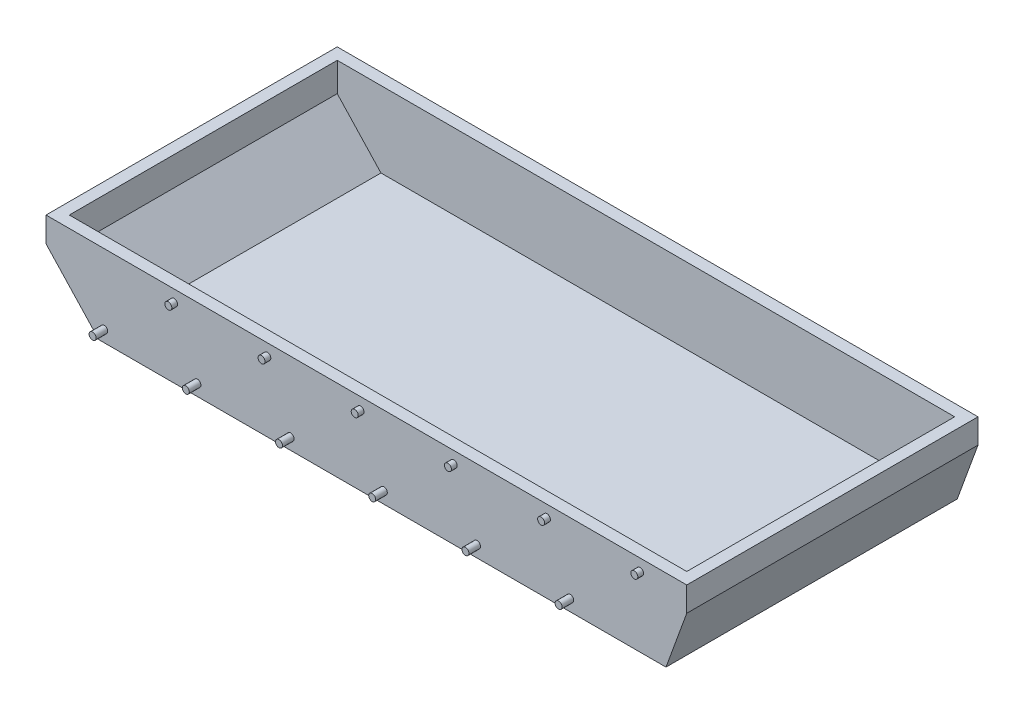
ISO-10303-21;
HEADER;
FILE_DESCRIPTION(('STEP AP214'),'2;1');
FILE_NAME('part.step','',(''),(''),'','','');
FILE_SCHEMA(('AUTOMOTIVE_DESIGN { 1 0 10303 214 1 1 1 1 }'));
ENDSEC;
DATA;
#1=APPLICATION_CONTEXT('core data for automotive mechanical design processes');
#2=APPLICATION_PROTOCOL_DEFINITION('international standard','automotive_design',2000,#1);
#3=PRODUCT_CONTEXT('',#1,'mechanical');
#4=PRODUCT('Part','Part','',(#3));
#5=PRODUCT_RELATED_PRODUCT_CATEGORY('part','',(#4));
#6=PRODUCT_DEFINITION_FORMATION('','',#4);
#7=PRODUCT_DEFINITION_CONTEXT('part definition',#1,'design');
#8=PRODUCT_DEFINITION('design','',#6,#7);
#9=PRODUCT_DEFINITION_SHAPE('','',#8);
#10=(LENGTH_UNIT() NAMED_UNIT(*) SI_UNIT(.MILLI.,.METRE.));
#11=(NAMED_UNIT(*) PLANE_ANGLE_UNIT() SI_UNIT($,.RADIAN.));
#12=(NAMED_UNIT(*) SI_UNIT($,.STERADIAN.) SOLID_ANGLE_UNIT());
#13=UNCERTAINTY_MEASURE_WITH_UNIT(LENGTH_MEASURE(1.E-05),#10,'distance_accuracy_value','');
#14=(GEOMETRIC_REPRESENTATION_CONTEXT(3) GLOBAL_UNCERTAINTY_ASSIGNED_CONTEXT((#13)) GLOBAL_UNIT_ASSIGNED_CONTEXT((#10,
#11,#12)) REPRESENTATION_CONTEXT('',''));
#15=CARTESIAN_POINT('',(0.,0.,0.));
#16=DIRECTION('',(0.,0.,1.));
#17=DIRECTION('',(1.,0.,0.));
#18=AXIS2_PLACEMENT_3D('',#15,#16,#17);
#19=CARTESIAN_POINT('',(240.,70.,125.));
#20=DIRECTION('',(0.,0.,-1.));
#21=DIRECTION('',(-1.,0.,0.));
#22=AXIS2_PLACEMENT_3D('',#19,#20,#21);
#23=PLANE('',#22);
#24=CARTESIAN_POINT('',(-240.,10.,125.));
#25=DIRECTION('',(0.,0.,-1.));
#26=DIRECTION('',(-1.,0.,0.));
#27=AXIS2_PLACEMENT_3D('',#24,#25,#26);
#28=CIRCLE('',#27,2.99999999999999);
#29=CARTESIAN_POINT('',(-243.,10.,125.));
#30=VERTEX_POINT('',#29);
#31=EDGE_CURVE('E11',#30,#30,#28,.F.);
#32=ORIENTED_EDGE('',*,*,#31,.F.);
#33=EDGE_LOOP('',(#32));
#34=FACE_BOUND('',#33,.T.);
#35=CARTESIAN_POINT('',(-160.,10.,125.));
#36=DIRECTION('',(0.,0.,-1.));
#37=DIRECTION('',(-1.,0.,0.));
#38=AXIS2_PLACEMENT_3D('',#35,#36,#37);
#39=CIRCLE('',#38,2.99999999999999);
#40=CARTESIAN_POINT('',(-163.,10.,125.));
#41=VERTEX_POINT('',#40);
#42=EDGE_CURVE('E50',#41,#41,#39,.F.);
#43=ORIENTED_EDGE('',*,*,#42,.F.);
#44=EDGE_LOOP('',(#43));
#45=FACE_BOUND('',#44,.T.);
#46=CARTESIAN_POINT('',(-80.0000000000001,10.,125.));
#47=DIRECTION('',(0.,0.,-1.));
#48=DIRECTION('',(-1.,0.,0.));
#49=AXIS2_PLACEMENT_3D('',#46,#47,#48);
#50=CIRCLE('',#49,3.00000000000001);
#51=CARTESIAN_POINT('',(-83.0000000000001,10.,125.));
#52=VERTEX_POINT('',#51);
#53=EDGE_CURVE('E306',#52,#52,#50,.F.);
#54=ORIENTED_EDGE('',*,*,#53,.F.);
#55=EDGE_LOOP('',(#54));
#56=FACE_BOUND('',#55,.T.);
#57=CARTESIAN_POINT('',(0.,10.,125.));
#58=DIRECTION('',(0.,0.,-1.));
#59=DIRECTION('',(-1.,0.,0.));
#60=AXIS2_PLACEMENT_3D('',#57,#58,#59);
#61=CIRCLE('',#60,3.);
#62=CARTESIAN_POINT('',(-3.00000000000007,10.,125.));
#63=VERTEX_POINT('',#62);
#64=EDGE_CURVE('E302',#63,#63,#61,.F.);
#65=ORIENTED_EDGE('',*,*,#64,.F.);
#66=EDGE_LOOP('',(#65));
#67=FACE_BOUND('',#66,.T.);
#68=CARTESIAN_POINT('',(79.9999999999999,10.,125.));
#69=DIRECTION('',(0.,0.,-1.));
#70=DIRECTION('',(-1.,0.,0.));
#71=AXIS2_PLACEMENT_3D('',#68,#69,#70);
#72=CIRCLE('',#71,3.00000000000001);
#73=CARTESIAN_POINT('',(76.9999999999999,10.,125.));
#74=VERTEX_POINT('',#73);
#75=EDGE_CURVE('E298',#74,#74,#72,.F.);
#76=ORIENTED_EDGE('',*,*,#75,.F.);
#77=EDGE_LOOP('',(#76));
#78=FACE_BOUND('',#77,.T.);
#79=CARTESIAN_POINT('',(160.,10.,125.));
#80=DIRECTION('',(0.,0.,-1.));
#81=DIRECTION('',(-1.,0.,0.));
#82=AXIS2_PLACEMENT_3D('',#79,#80,#81);
#83=CIRCLE('',#82,2.99999999999999);
#84=CARTESIAN_POINT('',(157.,10.,125.));
#85=VERTEX_POINT('',#84);
#86=EDGE_CURVE('E294',#85,#85,#83,.F.);
#87=ORIENTED_EDGE('',*,*,#86,.F.);
#88=EDGE_LOOP('',(#87));
#89=FACE_BOUND('',#88,.T.);
#90=CARTESIAN_POINT('',(-180.,60.,125.));
#91=DIRECTION('',(0.,0.,-1.));
#92=DIRECTION('',(-1.,0.,0.));
#93=AXIS2_PLACEMENT_3D('',#90,#91,#92);
#94=CIRCLE('',#93,2.99999999999999);
#95=CARTESIAN_POINT('',(-183.,60.,125.));
#96=VERTEX_POINT('',#95);
#97=EDGE_CURVE('E290',#96,#96,#94,.F.);
#98=ORIENTED_EDGE('',*,*,#97,.F.);
#99=EDGE_LOOP('',(#98));
#100=FACE_BOUND('',#99,.T.);
#101=CARTESIAN_POINT('',(-100.,60.,125.));
#102=DIRECTION('',(0.,0.,-1.));
#103=DIRECTION('',(-1.,0.,0.));
#104=AXIS2_PLACEMENT_3D('',#101,#102,#103);
#105=CIRCLE('',#104,2.99999999999999);
#106=CARTESIAN_POINT('',(-103.,60.,125.));
#107=VERTEX_POINT('',#106);
#108=EDGE_CURVE('E286',#107,#107,#105,.F.);
#109=ORIENTED_EDGE('',*,*,#108,.F.);
#110=EDGE_LOOP('',(#109));
#111=FACE_BOUND('',#110,.T.);
#112=CARTESIAN_POINT('',(-20.0000000000001,60.,125.));
#113=DIRECTION('',(0.,0.,-1.));
#114=DIRECTION('',(-1.,0.,0.));
#115=AXIS2_PLACEMENT_3D('',#112,#113,#114);
#116=CIRCLE('',#115,3.00000000000001);
#117=CARTESIAN_POINT('',(-23.0000000000001,60.,125.));
#118=VERTEX_POINT('',#117);
#119=EDGE_CURVE('E282',#118,#118,#116,.F.);
#120=ORIENTED_EDGE('',*,*,#119,.F.);
#121=EDGE_LOOP('',(#120));
#122=FACE_BOUND('',#121,.T.);
#123=CARTESIAN_POINT('',(59.9999999999999,60.,125.));
#124=DIRECTION('',(0.,0.,-1.));
#125=DIRECTION('',(-1.,0.,0.));
#126=AXIS2_PLACEMENT_3D('',#123,#124,#125);
#127=CIRCLE('',#126,3.00000000000001);
#128=CARTESIAN_POINT('',(56.9999999999999,60.,125.));
#129=VERTEX_POINT('',#128);
#130=EDGE_CURVE('E278',#129,#129,#127,.F.);
#131=ORIENTED_EDGE('',*,*,#130,.F.);
#132=EDGE_LOOP('',(#131));
#133=FACE_BOUND('',#132,.T.);
#134=CARTESIAN_POINT('',(140.,60.,125.));
#135=DIRECTION('',(0.,0.,-1.));
#136=DIRECTION('',(-1.,0.,0.));
#137=AXIS2_PLACEMENT_3D('',#134,#135,#136);
#138=CIRCLE('',#137,2.99999999999999);
#139=CARTESIAN_POINT('',(137.,60.,125.));
#140=VERTEX_POINT('',#139);
#141=EDGE_CURVE('E274',#140,#140,#138,.F.);
#142=ORIENTED_EDGE('',*,*,#141,.F.);
#143=EDGE_LOOP('',(#142));
#144=FACE_BOUND('',#143,.T.);
#145=CARTESIAN_POINT('',(220.,60.,125.));
#146=DIRECTION('',(0.,0.,-1.));
#147=DIRECTION('',(-1.,0.,0.));
#148=AXIS2_PLACEMENT_3D('',#145,#146,#147);
#149=CIRCLE('',#148,2.99999999999999);
#150=CARTESIAN_POINT('',(217.,60.,125.));
#151=VERTEX_POINT('',#150);
#152=EDGE_CURVE('E270',#151,#151,#149,.F.);
#153=ORIENTED_EDGE('',*,*,#152,.F.);
#154=EDGE_LOOP('',(#153));
#155=FACE_BOUND('',#154,.T.);
#156=DIRECTION('',(1.,0.,0.));
#157=VECTOR('',#156,1.);
#158=CARTESIAN_POINT('',(240.,0.,125.));
#159=LINE('',#158,#157);
#160=CARTESIAN_POINT('',(-244.662575430689,0.,125.));
#161=VERTEX_POINT('',#160);
#162=CARTESIAN_POINT('',(242.183821405597,0.,125.));
#163=VERTEX_POINT('',#162);
#164=EDGE_CURVE('E228',#161,#163,#159,.T.);
#165=ORIENTED_EDGE('',*,*,#164,.T.);
#166=DIRECTION('',(-0.342020143325675,-0.939692620785906,0.));
#167=VECTOR('',#166,1.);
#168=CARTESIAN_POINT('',(264.425929168089,61.1096888385208,125.));
#169=LINE('',#168,#167);
#170=CARTESIAN_POINT('',(260.,48.9495483890911,125.));
#171=VERTEX_POINT('',#170);
#172=EDGE_CURVE('E267',#163,#171,#169,.F.);
#173=ORIENTED_EDGE('',*,*,#172,.T.);
#174=DIRECTION('',(0.,-1.,0.));
#175=VECTOR('',#174,1.);
#176=CARTESIAN_POINT('',(260.,70.,125.));
#177=LINE('',#176,#175);
#178=CARTESIAN_POINT('',(260.,70.,125.));
#179=VERTEX_POINT('',#178);
#180=EDGE_CURVE('E65',#179,#171,#177,.T.);
#181=ORIENTED_EDGE('',*,*,#180,.F.);
#182=DIRECTION('',(1.,0.,0.));
#183=VECTOR('',#182,1.);
#184=CARTESIAN_POINT('',(240.,70.,125.));
#185=LINE('',#184,#183);
#186=CARTESIAN_POINT('',(-290.,70.,125.));
#187=VERTEX_POINT('',#186);
#188=EDGE_CURVE('E229',#187,#179,#185,.T.);
#189=ORIENTED_EDGE('',*,*,#188,.F.);
#190=DIRECTION('',(0.,1.,0.));
#191=VECTOR('',#190,1.);
#192=CARTESIAN_POINT('',(-290.,70.,125.));
#193=LINE('',#192,#191);
#194=CARTESIAN_POINT('',(-290.,48.6184355012332,125.));
#195=VERTEX_POINT('',#194);
#196=EDGE_CURVE('E220',#195,#187,#193,.T.);
#197=ORIENTED_EDGE('',*,*,#196,.F.);
#198=DIRECTION('',(-0.681998360062502,0.731353701619167,0.));
#199=VECTOR('',#198,1.);
#200=CARTESIAN_POINT('',(-54.1502055833312,-204.299504296954,125.));
#201=LINE('',#200,#199);
#202=EDGE_CURVE('E244',#195,#161,#201,.F.);
#203=ORIENTED_EDGE('',*,*,#202,.T.);
#204=EDGE_LOOP('',(#165,#173,#181,#189,#197,#203));
#205=FACE_BOUND('',#204,.T.);
#206=ADVANCED_FACE('F41',(#34,#45,#56,#67,#78,#89,#100,#111,#122,#133,#144,#155,#205),#23,.F.);
#207=CARTESIAN_POINT('',(240.,70.,-125.));
#208=DIRECTION('',(0.,0.,1.));
#209=DIRECTION('',(1.,0.,0.));
#210=AXIS2_PLACEMENT_3D('',#207,#208,#209);
#211=PLANE('',#210);
#212=DIRECTION('',(-1.,0.,0.));
#213=VECTOR('',#212,1.);
#214=CARTESIAN_POINT('',(240.,0.,-125.));
#215=LINE('',#214,#213);
#216=CARTESIAN_POINT('',(242.183821405597,0.,-125.));
#217=VERTEX_POINT('',#216);
#218=CARTESIAN_POINT('',(-244.662575430689,0.,-125.));
#219=VERTEX_POINT('',#218);
#220=EDGE_CURVE('E233',#217,#219,#215,.T.);
#221=ORIENTED_EDGE('',*,*,#220,.T.);
#222=DIRECTION('',(0.681998360062502,-0.731353701619167,0.));
#223=VECTOR('',#222,1.);
#224=CARTESIAN_POINT('',(-54.1502055833312,-204.299504296954,-125.));
#225=LINE('',#224,#223);
#226=CARTESIAN_POINT('',(-290.,48.6184355012332,-125.));
#227=VERTEX_POINT('',#226);
#228=EDGE_CURVE('E252',#219,#227,#225,.F.);
#229=ORIENTED_EDGE('',*,*,#228,.T.);
#230=DIRECTION('',(0.,-1.,0.));
#231=VECTOR('',#230,1.);
#232=CARTESIAN_POINT('',(-290.,70.,-125.));
#233=LINE('',#232,#231);
#234=CARTESIAN_POINT('',(-290.,70.,-125.));
#235=VERTEX_POINT('',#234);
#236=EDGE_CURVE('E217',#235,#227,#233,.T.);
#237=ORIENTED_EDGE('',*,*,#236,.F.);
#238=DIRECTION('',(-1.,0.,0.));
#239=VECTOR('',#238,1.);
#240=CARTESIAN_POINT('',(240.,70.,-125.));
#241=LINE('',#240,#239);
#242=CARTESIAN_POINT('',(260.,70.,-125.));
#243=VERTEX_POINT('',#242);
#244=EDGE_CURVE('E232',#243,#235,#241,.T.);
#245=ORIENTED_EDGE('',*,*,#244,.F.);
#246=DIRECTION('',(0.,1.,0.));
#247=VECTOR('',#246,1.);
#248=CARTESIAN_POINT('',(260.,70.,-125.));
#249=LINE('',#248,#247);
#250=CARTESIAN_POINT('',(260.,48.9495483890911,-125.));
#251=VERTEX_POINT('',#250);
#252=EDGE_CURVE('E162',#251,#243,#249,.T.);
#253=ORIENTED_EDGE('',*,*,#252,.F.);
#254=DIRECTION('',(0.342020143325675,0.939692620785906,0.));
#255=VECTOR('',#254,1.);
#256=CARTESIAN_POINT('',(264.425929168089,61.1096888385208,-125.));
#257=LINE('',#256,#255);
#258=EDGE_CURVE('E259',#251,#217,#257,.F.);
#259=ORIENTED_EDGE('',*,*,#258,.T.);
#260=EDGE_LOOP('',(#221,#229,#237,#245,#253,#259));
#261=FACE_BOUND('',#260,.T.);
#262=ADVANCED_FACE('F317',(#261),#211,.F.);
#263=CARTESIAN_POINT('',(0.,70.,0.));
#264=DIRECTION('',(0.,1.,0.));
#265=DIRECTION('',(0.,0.,1.));
#266=AXIS2_PLACEMENT_3D('',#263,#264,#265);
#267=PLANE('',#266);
#268=DIRECTION('',(-1.,0.,0.));
#269=VECTOR('',#268,1.);
#270=CARTESIAN_POINT('',(240.,70.,-115.));
#271=LINE('',#270,#269);
#272=CARTESIAN_POINT('',(250.,70.,-115.));
#273=VERTEX_POINT('',#272);
#274=CARTESIAN_POINT('',(-280.,70.,-115.));
#275=VERTEX_POINT('',#274);
#276=EDGE_CURVE('E198',#273,#275,#271,.T.);
#277=ORIENTED_EDGE('',*,*,#276,.F.);
#278=DIRECTION('',(0.,0.,1.));
#279=VECTOR('',#278,1.);
#280=CARTESIAN_POINT('',(250.,70.,0.));
#281=LINE('',#280,#279);
#282=CARTESIAN_POINT('',(250.,70.,115.));
#283=VERTEX_POINT('',#282);
#284=EDGE_CURVE('E190',#273,#283,#281,.T.);
#285=ORIENTED_EDGE('',*,*,#284,.T.);
#286=DIRECTION('',(1.,0.,0.));
#287=VECTOR('',#286,1.);
#288=CARTESIAN_POINT('',(240.,70.,115.));
#289=LINE('',#288,#287);
#290=CARTESIAN_POINT('',(-280.,70.,115.));
#291=VERTEX_POINT('',#290);
#292=EDGE_CURVE('E182',#291,#283,#289,.T.);
#293=ORIENTED_EDGE('',*,*,#292,.F.);
#294=DIRECTION('',(0.,0.,-1.));
#295=VECTOR('',#294,1.);
#296=CARTESIAN_POINT('',(-280.,70.,0.));
#297=LINE('',#296,#295);
#298=EDGE_CURVE('E146',#291,#275,#297,.T.);
#299=ORIENTED_EDGE('',*,*,#298,.T.);
#300=EDGE_LOOP('',(#277,#285,#293,#299));
#301=FACE_BOUND('',#300,.T.);
#302=ORIENTED_EDGE('',*,*,#244,.T.);
#303=DIRECTION('',(0.,0.,-1.));
#304=VECTOR('',#303,1.);
#305=CARTESIAN_POINT('',(-290.,70.,-125.));
#306=LINE('',#305,#304);
#307=EDGE_CURVE('E224',#187,#235,#306,.T.);
#308=ORIENTED_EDGE('',*,*,#307,.F.);
#309=ORIENTED_EDGE('',*,*,#188,.T.);
#310=DIRECTION('',(0.,0.,1.));
#311=VECTOR('',#310,1.);
#312=CARTESIAN_POINT('',(260.,70.,125.));
#313=LINE('',#312,#311);
#314=EDGE_CURVE('E214',#243,#179,#313,.T.);
#315=ORIENTED_EDGE('',*,*,#314,.F.);
#316=EDGE_LOOP('',(#302,#308,#309,#315));
#317=FACE_BOUND('',#316,.T.);
#318=ADVANCED_FACE('F353',(#301,#317),#267,.T.);
#319=CARTESIAN_POINT('',(0.,0.,0.));
#320=DIRECTION('',(0.,1.,0.));
#321=DIRECTION('',(0.,0.,1.));
#322=AXIS2_PLACEMENT_3D('',#319,#320,#321);
#323=PLANE('',#322);
#324=ORIENTED_EDGE('',*,*,#164,.F.);
#325=DIRECTION('',(0.,0.,1.));
#326=VECTOR('',#325,1.);
#327=CARTESIAN_POINT('',(-244.662575430689,0.,0.));
#328=LINE('',#327,#326);
#329=EDGE_CURVE('E248',#161,#219,#328,.F.);
#330=ORIENTED_EDGE('',*,*,#329,.T.);
#331=ORIENTED_EDGE('',*,*,#220,.F.);
#332=DIRECTION('',(0.,0.,-1.));
#333=VECTOR('',#332,1.);
#334=CARTESIAN_POINT('',(242.183821405597,0.,0.));
#335=LINE('',#334,#333);
#336=EDGE_CURVE('E263',#217,#163,#335,.F.);
#337=ORIENTED_EDGE('',*,*,#336,.T.);
#338=EDGE_LOOP('',(#324,#330,#331,#337));
#339=FACE_BOUND('',#338,.T.);
#340=ADVANCED_FACE('F346',(#339),#323,.F.);
#341=CARTESIAN_POINT('',(-290.,0.,0.));
#342=DIRECTION('',(-1.,0.,0.));
#343=DIRECTION('',(0.,0.,1.));
#344=AXIS2_PLACEMENT_3D('',#341,#342,#343);
#345=PLANE('',#344);
#346=ORIENTED_EDGE('',*,*,#236,.T.);
#347=DIRECTION('',(0.,0.,-1.));
#348=VECTOR('',#347,1.);
#349=CARTESIAN_POINT('',(-290.,48.6184355012332,-125.));
#350=LINE('',#349,#348);
#351=EDGE_CURVE('E236',#227,#195,#350,.F.);
#352=ORIENTED_EDGE('',*,*,#351,.T.);
#353=ORIENTED_EDGE('',*,*,#196,.T.);
#354=ORIENTED_EDGE('',*,*,#307,.T.);
#355=EDGE_LOOP('',(#346,#352,#353,#354));
#356=FACE_BOUND('',#355,.T.);
#357=ADVANCED_FACE('F356',(#356),#345,.T.);
#358=CARTESIAN_POINT('',(-291.288329737572,50.,-125.));
#359=DIRECTION('',(-0.731353701619167,-0.681998360062502,0.));
#360=DIRECTION('',(0.,0.,-1.));
#361=AXIS2_PLACEMENT_3D('',#358,#359,#360);
#362=PLANE('',#361);
#363=ORIENTED_EDGE('',*,*,#228,.F.);
#364=ORIENTED_EDGE('',*,*,#329,.F.);
#365=ORIENTED_EDGE('',*,*,#202,.F.);
#366=ORIENTED_EDGE('',*,*,#351,.F.);
#367=EDGE_LOOP('',(#363,#364,#365,#366));
#368=FACE_BOUND('',#367,.T.);
#369=ADVANCED_FACE('F361',(#368),#362,.T.);
#370=CARTESIAN_POINT('',(260.,0.,0.));
#371=DIRECTION('',(1.,0.,0.));
#372=DIRECTION('',(0.,0.,-1.));
#373=AXIS2_PLACEMENT_3D('',#370,#371,#372);
#374=PLANE('',#373);
#375=ORIENTED_EDGE('',*,*,#180,.T.);
#376=DIRECTION('',(0.,0.,1.));
#377=VECTOR('',#376,1.);
#378=CARTESIAN_POINT('',(260.,48.9495483890911,125.));
#379=LINE('',#378,#377);
#380=EDGE_CURVE('E256',#171,#251,#379,.F.);
#381=ORIENTED_EDGE('',*,*,#380,.T.);
#382=ORIENTED_EDGE('',*,*,#252,.T.);
#383=ORIENTED_EDGE('',*,*,#314,.T.);
#384=EDGE_LOOP('',(#375,#381,#382,#383));
#385=FACE_BOUND('',#384,.T.);
#386=ADVANCED_FACE('F349',(#385),#374,.T.);
#387=CARTESIAN_POINT('',(260.382333118908,50.,125.));
#388=DIRECTION('',(0.939692620785906,-0.342020143325675,0.));
#389=DIRECTION('',(0.,0.,1.));
#390=AXIS2_PLACEMENT_3D('',#387,#388,#389);
#391=PLANE('',#390);
#392=ORIENTED_EDGE('',*,*,#172,.F.);
#393=ORIENTED_EDGE('',*,*,#336,.F.);
#394=ORIENTED_EDGE('',*,*,#258,.F.);
#395=ORIENTED_EDGE('',*,*,#380,.F.);
#396=EDGE_LOOP('',(#392,#393,#394,#395));
#397=FACE_BOUND('',#396,.T.);
#398=ADVANCED_FACE('F43',(#397),#391,.T.);
#399=CARTESIAN_POINT('',(240.,70.,115.));
#400=DIRECTION('',(0.,0.,-1.));
#401=DIRECTION('',(-1.,0.,0.));
#402=AXIS2_PLACEMENT_3D('',#399,#400,#401);
#403=PLANE('',#402);
#404=DIRECTION('',(1.,0.,0.));
#405=VECTOR('',#404,1.);
#406=CARTESIAN_POINT('',(240.,5.,115.));
#407=LINE('',#406,#405);
#408=CARTESIAN_POINT('',(-242.488513555884,5.,115.));
#409=VERTEX_POINT('',#408);
#410=CARTESIAN_POINT('',(238.682783714549,5.,115.));
#411=VERTEX_POINT('',#410);
#412=EDGE_CURVE('E134',#409,#411,#407,.T.);
#413=ORIENTED_EDGE('',*,*,#412,.F.);
#414=DIRECTION('',(-0.681998360062502,0.731353701619167,0.));
#415=VECTOR('',#414,1.);
#416=CARTESIAN_POINT('',(-50.4934370752354,-200.889512496641,115.));
#417=LINE('',#416,#415);
#418=CARTESIAN_POINT('',(-280.,45.2261443291846,115.));
#419=VERTEX_POINT('',#418);
#420=EDGE_CURVE('E174',#419,#409,#417,.F.);
#421=ORIENTED_EDGE('',*,*,#420,.F.);
#422=DIRECTION('',(0.,1.,0.));
#423=VECTOR('',#422,1.);
#424=CARTESIAN_POINT('',(-280.,70.,115.));
#425=LINE('',#424,#423);
#426=EDGE_CURVE('E170',#419,#291,#425,.T.);
#427=ORIENTED_EDGE('',*,*,#426,.T.);
#428=ORIENTED_EDGE('',*,*,#292,.T.);
#429=DIRECTION('',(0.,-1.,0.));
#430=VECTOR('',#429,1.);
#431=CARTESIAN_POINT('',(250.,70.,115.));
#432=LINE('',#431,#430);
#433=CARTESIAN_POINT('',(250.,36.0937961953605,115.));
#434=VERTEX_POINT('',#433);
#435=EDGE_CURVE('E57',#283,#434,#432,.T.);
#436=ORIENTED_EDGE('',*,*,#435,.T.);
#437=DIRECTION('',(-0.342020143325675,-0.939692620785906,0.));
#438=VECTOR('',#437,1.);
#439=CARTESIAN_POINT('',(259.727466064159,62.8197895551492,115.));
#440=LINE('',#439,#438);
#441=EDGE_CURVE('E153',#411,#434,#440,.F.);
#442=ORIENTED_EDGE('',*,*,#441,.F.);
#443=EDGE_LOOP('',(#413,#421,#427,#428,#436,#442));
#444=FACE_BOUND('',#443,.T.);
#445=ADVANCED_FACE('F158',(#444),#403,.T.);
#446=CARTESIAN_POINT('',(240.,70.,-115.));
#447=DIRECTION('',(0.,0.,1.));
#448=DIRECTION('',(1.,0.,0.));
#449=AXIS2_PLACEMENT_3D('',#446,#447,#448);
#450=PLANE('',#449);
#451=DIRECTION('',(-1.,0.,0.));
#452=VECTOR('',#451,1.);
#453=CARTESIAN_POINT('',(240.,5.,-115.));
#454=LINE('',#453,#452);
#455=CARTESIAN_POINT('',(238.682783714549,5.,-115.));
#456=VERTEX_POINT('',#455);
#457=CARTESIAN_POINT('',(-242.488513555884,5.,-115.));
#458=VERTEX_POINT('',#457);
#459=EDGE_CURVE('E145',#456,#458,#454,.T.);
#460=ORIENTED_EDGE('',*,*,#459,.F.);
#461=DIRECTION('',(0.342020143325675,0.939692620785906,0.));
#462=VECTOR('',#461,1.);
#463=CARTESIAN_POINT('',(259.727466064159,62.8197895551492,-115.));
#464=LINE('',#463,#462);
#465=CARTESIAN_POINT('',(250.,36.0937961953605,-115.));
#466=VERTEX_POINT('',#465);
#467=EDGE_CURVE('E155',#466,#456,#464,.F.);
#468=ORIENTED_EDGE('',*,*,#467,.F.);
#469=DIRECTION('',(0.,1.,0.));
#470=VECTOR('',#469,1.);
#471=CARTESIAN_POINT('',(250.,70.,-115.));
#472=LINE('',#471,#470);
#473=EDGE_CURVE('E168',#466,#273,#472,.T.);
#474=ORIENTED_EDGE('',*,*,#473,.T.);
#475=ORIENTED_EDGE('',*,*,#276,.T.);
#476=DIRECTION('',(0.,-1.,0.));
#477=VECTOR('',#476,1.);
#478=CARTESIAN_POINT('',(-280.,70.,-115.));
#479=LINE('',#478,#477);
#480=CARTESIAN_POINT('',(-280.,45.2261443291846,-115.));
#481=VERTEX_POINT('',#480);
#482=EDGE_CURVE('E173',#275,#481,#479,.T.);
#483=ORIENTED_EDGE('',*,*,#482,.T.);
#484=DIRECTION('',(0.681998360062502,-0.731353701619167,0.));
#485=VECTOR('',#484,1.);
#486=CARTESIAN_POINT('',(-50.4934370752354,-200.889512496641,-115.));
#487=LINE('',#486,#485);
#488=EDGE_CURVE('E180',#458,#481,#487,.F.);
#489=ORIENTED_EDGE('',*,*,#488,.F.);
#490=EDGE_LOOP('',(#460,#468,#474,#475,#483,#489));
#491=FACE_BOUND('',#490,.T.);
#492=ADVANCED_FACE('F397',(#491),#450,.T.);
#493=CARTESIAN_POINT('',(0.,5.,0.));
#494=DIRECTION('',(0.,1.,0.));
#495=DIRECTION('',(0.,0.,1.));
#496=AXIS2_PLACEMENT_3D('',#493,#494,#495);
#497=PLANE('',#496);
#498=ORIENTED_EDGE('',*,*,#412,.T.);
#499=DIRECTION('',(0.,0.,-1.));
#500=VECTOR('',#499,1.);
#501=CARTESIAN_POINT('',(238.682783714549,5.,0.));
#502=LINE('',#501,#500);
#503=EDGE_CURVE('E137',#456,#411,#502,.F.);
#504=ORIENTED_EDGE('',*,*,#503,.F.);
#505=ORIENTED_EDGE('',*,*,#459,.T.);
#506=DIRECTION('',(0.,0.,1.));
#507=VECTOR('',#506,1.);
#508=CARTESIAN_POINT('',(-242.488513555884,5.,0.));
#509=LINE('',#508,#507);
#510=EDGE_CURVE('E139',#409,#458,#509,.F.);
#511=ORIENTED_EDGE('',*,*,#510,.F.);
#512=EDGE_LOOP('',(#498,#504,#505,#511));
#513=FACE_BOUND('',#512,.T.);
#514=ADVANCED_FACE('F136',(#513),#497,.T.);
#515=CARTESIAN_POINT('',(-280.,0.,0.));
#516=DIRECTION('',(-1.,0.,0.));
#517=DIRECTION('',(0.,0.,1.));
#518=AXIS2_PLACEMENT_3D('',#515,#516,#517);
#519=PLANE('',#518);
#520=ORIENTED_EDGE('',*,*,#482,.F.);
#521=ORIENTED_EDGE('',*,*,#298,.F.);
#522=ORIENTED_EDGE('',*,*,#426,.F.);
#523=DIRECTION('',(0.,0.,-1.));
#524=VECTOR('',#523,1.);
#525=CARTESIAN_POINT('',(-280.,45.2261443291846,-125.));
#526=LINE('',#525,#524);
#527=EDGE_CURVE('E177',#481,#419,#526,.F.);
#528=ORIENTED_EDGE('',*,*,#527,.F.);
#529=EDGE_LOOP('',(#520,#521,#522,#528));
#530=FACE_BOUND('',#529,.T.);
#531=ADVANCED_FACE('F390',(#530),#519,.F.);
#532=CARTESIAN_POINT('',(-287.631561229477,53.4099918003125,-125.));
#533=DIRECTION('',(-0.731353701619167,-0.681998360062502,0.));
#534=DIRECTION('',(0.,0.,-1.));
#535=AXIS2_PLACEMENT_3D('',#532,#533,#534);
#536=PLANE('',#535);
#537=ORIENTED_EDGE('',*,*,#488,.T.);
#538=ORIENTED_EDGE('',*,*,#527,.T.);
#539=ORIENTED_EDGE('',*,*,#420,.T.);
#540=ORIENTED_EDGE('',*,*,#510,.T.);
#541=EDGE_LOOP('',(#537,#538,#539,#540));
#542=FACE_BOUND('',#541,.T.);
#543=ADVANCED_FACE('F387',(#542),#536,.F.);
#544=CARTESIAN_POINT('',(250.,0.,0.));
#545=DIRECTION('',(1.,0.,0.));
#546=DIRECTION('',(0.,0.,-1.));
#547=AXIS2_PLACEMENT_3D('',#544,#545,#546);
#548=PLANE('',#547);
#549=ORIENTED_EDGE('',*,*,#435,.F.);
#550=ORIENTED_EDGE('',*,*,#284,.F.);
#551=ORIENTED_EDGE('',*,*,#473,.F.);
#552=DIRECTION('',(0.,0.,1.));
#553=VECTOR('',#552,1.);
#554=CARTESIAN_POINT('',(250.,36.0937961953605,125.));
#555=LINE('',#554,#553);
#556=EDGE_CURVE('E187',#434,#466,#555,.F.);
#557=ORIENTED_EDGE('',*,*,#556,.F.);
#558=EDGE_LOOP('',(#549,#550,#551,#557));
#559=FACE_BOUND('',#558,.T.);
#560=ADVANCED_FACE('F384',(#559),#548,.F.);
#561=CARTESIAN_POINT('',(255.683870014978,51.7101007166284,125.));
#562=DIRECTION('',(0.939692620785906,-0.342020143325675,0.));
#563=DIRECTION('',(0.,0.,1.));
#564=AXIS2_PLACEMENT_3D('',#561,#562,#563);
#565=PLANE('',#564);
#566=ORIENTED_EDGE('',*,*,#441,.T.);
#567=ORIENTED_EDGE('',*,*,#556,.T.);
#568=ORIENTED_EDGE('',*,*,#467,.T.);
#569=ORIENTED_EDGE('',*,*,#503,.T.);
#570=EDGE_LOOP('',(#566,#567,#568,#569));
#571=FACE_BOUND('',#570,.T.);
#572=ADVANCED_FACE('F151',(#571),#565,.F.);
#573=CARTESIAN_POINT('',(220.,60.,130.));
#574=DIRECTION('',(0.,0.,-1.));
#575=DIRECTION('',(-1.,0.,0.));
#576=AXIS2_PLACEMENT_3D('',#573,#574,#575);
#577=CYLINDRICAL_SURFACE('',#576,2.99999999999999);
#578=CARTESIAN_POINT('',(220.,60.,130.));
#579=DIRECTION('',(0.,0.,1.));
#580=DIRECTION('',(1.,0.,0.));
#581=AXIS2_PLACEMENT_3D('',#578,#579,#580);
#582=CIRCLE('',#581,2.99999999999999);
#583=CARTESIAN_POINT('',(223.,60.,130.));
#584=VERTEX_POINT('',#583);
#585=EDGE_CURVE('E169',#584,#584,#582,.T.);
#586=ORIENTED_EDGE('',*,*,#585,.F.);
#587=EDGE_LOOP('',(#586));
#588=FACE_BOUND('',#587,.T.);
#589=ORIENTED_EDGE('',*,*,#152,.T.);
#590=EDGE_LOOP('',(#589));
#591=FACE_BOUND('',#590,.T.);
#592=ADVANCED_FACE('F383',(#588,#591),#577,.T.);
#593=CARTESIAN_POINT('',(220.,60.,130.));
#594=DIRECTION('',(0.,0.,1.));
#595=DIRECTION('',(1.,0.,0.));
#596=AXIS2_PLACEMENT_3D('',#593,#594,#595);
#597=PLANE('',#596);
#598=ORIENTED_EDGE('',*,*,#585,.T.);
#599=EDGE_LOOP('',(#598));
#600=FACE_BOUND('',#599,.T.);
#601=ADVANCED_FACE('F405',(#600),#597,.T.);
#602=CARTESIAN_POINT('',(140.,60.,130.));
#603=DIRECTION('',(0.,0.,-1.));
#604=DIRECTION('',(-1.,0.,0.));
#605=AXIS2_PLACEMENT_3D('',#602,#603,#604);
#606=CYLINDRICAL_SURFACE('',#605,2.99999999999999);
#607=CARTESIAN_POINT('',(140.,60.,130.));
#608=DIRECTION('',(0.,0.,1.));
#609=DIRECTION('',(1.,0.,0.));
#610=AXIS2_PLACEMENT_3D('',#607,#608,#609);
#611=CIRCLE('',#610,2.99999999999999);
#612=CARTESIAN_POINT('',(143.,60.,130.));
#613=VERTEX_POINT('',#612);
#614=EDGE_CURVE('E540',#613,#613,#611,.T.);
#615=ORIENTED_EDGE('',*,*,#614,.F.);
#616=EDGE_LOOP('',(#615));
#617=FACE_BOUND('',#616,.T.);
#618=ORIENTED_EDGE('',*,*,#141,.T.);
#619=EDGE_LOOP('',(#618));
#620=FACE_BOUND('',#619,.T.);
#621=ADVANCED_FACE('F409',(#617,#620),#606,.T.);
#622=CARTESIAN_POINT('',(140.,60.,130.));
#623=DIRECTION('',(0.,0.,1.));
#624=DIRECTION('',(1.,0.,0.));
#625=AXIS2_PLACEMENT_3D('',#622,#623,#624);
#626=PLANE('',#625);
#627=ORIENTED_EDGE('',*,*,#614,.T.);
#628=EDGE_LOOP('',(#627));
#629=FACE_BOUND('',#628,.T.);
#630=ADVANCED_FACE('F413',(#629),#626,.T.);
#631=CARTESIAN_POINT('',(59.9999999999999,60.,130.));
#632=DIRECTION('',(0.,0.,-1.));
#633=DIRECTION('',(-1.,0.,0.));
#634=AXIS2_PLACEMENT_3D('',#631,#632,#633);
#635=CYLINDRICAL_SURFACE('',#634,3.00000000000001);
#636=CARTESIAN_POINT('',(59.9999999999999,60.,130.));
#637=DIRECTION('',(0.,0.,1.));
#638=DIRECTION('',(1.,0.,0.));
#639=AXIS2_PLACEMENT_3D('',#636,#637,#638);
#640=CIRCLE('',#639,3.00000000000001);
#641=CARTESIAN_POINT('',(62.9999999999999,60.,130.));
#642=VERTEX_POINT('',#641);
#643=EDGE_CURVE('E536',#642,#642,#640,.T.);
#644=ORIENTED_EDGE('',*,*,#643,.F.);
#645=EDGE_LOOP('',(#644));
#646=FACE_BOUND('',#645,.T.);
#647=ORIENTED_EDGE('',*,*,#130,.T.);
#648=EDGE_LOOP('',(#647));
#649=FACE_BOUND('',#648,.T.);
#650=ADVANCED_FACE('F417',(#646,#649),#635,.T.);
#651=CARTESIAN_POINT('',(59.9999999999999,60.,130.));
#652=DIRECTION('',(0.,0.,1.));
#653=DIRECTION('',(1.,0.,0.));
#654=AXIS2_PLACEMENT_3D('',#651,#652,#653);
#655=PLANE('',#654);
#656=ORIENTED_EDGE('',*,*,#643,.T.);
#657=EDGE_LOOP('',(#656));
#658=FACE_BOUND('',#657,.T.);
#659=ADVANCED_FACE('F421',(#658),#655,.T.);
#660=CARTESIAN_POINT('',(-20.0000000000001,60.,130.));
#661=DIRECTION('',(0.,0.,-1.));
#662=DIRECTION('',(-1.,0.,0.));
#663=AXIS2_PLACEMENT_3D('',#660,#661,#662);
#664=CYLINDRICAL_SURFACE('',#663,3.00000000000001);
#665=CARTESIAN_POINT('',(-20.0000000000001,60.,130.));
#666=DIRECTION('',(0.,0.,1.));
#667=DIRECTION('',(1.,0.,0.));
#668=AXIS2_PLACEMENT_3D('',#665,#666,#667);
#669=CIRCLE('',#668,3.00000000000001);
#670=CARTESIAN_POINT('',(-17.0000000000001,60.,130.));
#671=VERTEX_POINT('',#670);
#672=EDGE_CURVE('E532',#671,#671,#669,.T.);
#673=ORIENTED_EDGE('',*,*,#672,.F.);
#674=EDGE_LOOP('',(#673));
#675=FACE_BOUND('',#674,.T.);
#676=ORIENTED_EDGE('',*,*,#119,.T.);
#677=EDGE_LOOP('',(#676));
#678=FACE_BOUND('',#677,.T.);
#679=ADVANCED_FACE('F425',(#675,#678),#664,.T.);
#680=CARTESIAN_POINT('',(-20.0000000000001,60.,130.));
#681=DIRECTION('',(0.,0.,1.));
#682=DIRECTION('',(1.,0.,0.));
#683=AXIS2_PLACEMENT_3D('',#680,#681,#682);
#684=PLANE('',#683);
#685=ORIENTED_EDGE('',*,*,#672,.T.);
#686=EDGE_LOOP('',(#685));
#687=FACE_BOUND('',#686,.T.);
#688=ADVANCED_FACE('F429',(#687),#684,.T.);
#689=CARTESIAN_POINT('',(-100.,60.,130.));
#690=DIRECTION('',(0.,0.,-1.));
#691=DIRECTION('',(-1.,0.,0.));
#692=AXIS2_PLACEMENT_3D('',#689,#690,#691);
#693=CYLINDRICAL_SURFACE('',#692,2.99999999999999);
#694=CARTESIAN_POINT('',(-100.,60.,130.));
#695=DIRECTION('',(0.,0.,1.));
#696=DIRECTION('',(1.,0.,0.));
#697=AXIS2_PLACEMENT_3D('',#694,#695,#696);
#698=CIRCLE('',#697,2.99999999999999);
#699=CARTESIAN_POINT('',(-97.0000000000001,60.,130.));
#700=VERTEX_POINT('',#699);
#701=EDGE_CURVE('E528',#700,#700,#698,.T.);
#702=ORIENTED_EDGE('',*,*,#701,.F.);
#703=EDGE_LOOP('',(#702));
#704=FACE_BOUND('',#703,.T.);
#705=ORIENTED_EDGE('',*,*,#108,.T.);
#706=EDGE_LOOP('',(#705));
#707=FACE_BOUND('',#706,.T.);
#708=ADVANCED_FACE('F433',(#704,#707),#693,.T.);
#709=CARTESIAN_POINT('',(-100.,60.,130.));
#710=DIRECTION('',(0.,0.,1.));
#711=DIRECTION('',(1.,0.,0.));
#712=AXIS2_PLACEMENT_3D('',#709,#710,#711);
#713=PLANE('',#712);
#714=ORIENTED_EDGE('',*,*,#701,.T.);
#715=EDGE_LOOP('',(#714));
#716=FACE_BOUND('',#715,.T.);
#717=ADVANCED_FACE('F437',(#716),#713,.T.);
#718=CARTESIAN_POINT('',(-180.,60.,130.));
#719=DIRECTION('',(0.,0.,-1.));
#720=DIRECTION('',(-1.,0.,0.));
#721=AXIS2_PLACEMENT_3D('',#718,#719,#720);
#722=CYLINDRICAL_SURFACE('',#721,2.99999999999999);
#723=CARTESIAN_POINT('',(-180.,60.,130.));
#724=DIRECTION('',(0.,0.,1.));
#725=DIRECTION('',(1.,0.,0.));
#726=AXIS2_PLACEMENT_3D('',#723,#724,#725);
#727=CIRCLE('',#726,2.99999999999999);
#728=CARTESIAN_POINT('',(-177.,60.,130.));
#729=VERTEX_POINT('',#728);
#730=EDGE_CURVE('E524',#729,#729,#727,.T.);
#731=ORIENTED_EDGE('',*,*,#730,.F.);
#732=EDGE_LOOP('',(#731));
#733=FACE_BOUND('',#732,.T.);
#734=ORIENTED_EDGE('',*,*,#97,.T.);
#735=EDGE_LOOP('',(#734));
#736=FACE_BOUND('',#735,.T.);
#737=ADVANCED_FACE('F441',(#733,#736),#722,.T.);
#738=CARTESIAN_POINT('',(-180.,60.,130.));
#739=DIRECTION('',(0.,0.,1.));
#740=DIRECTION('',(1.,0.,0.));
#741=AXIS2_PLACEMENT_3D('',#738,#739,#740);
#742=PLANE('',#741);
#743=ORIENTED_EDGE('',*,*,#730,.T.);
#744=EDGE_LOOP('',(#743));
#745=FACE_BOUND('',#744,.T.);
#746=ADVANCED_FACE('F445',(#745),#742,.T.);
#747=CARTESIAN_POINT('',(160.,10.,135.));
#748=DIRECTION('',(0.,0.,-1.));
#749=DIRECTION('',(-1.,0.,0.));
#750=AXIS2_PLACEMENT_3D('',#747,#748,#749);
#751=CYLINDRICAL_SURFACE('',#750,2.99999999999999);
#752=CARTESIAN_POINT('',(160.,10.,135.));
#753=DIRECTION('',(0.,0.,1.));
#754=DIRECTION('',(1.,0.,0.));
#755=AXIS2_PLACEMENT_3D('',#752,#753,#754);
#756=CIRCLE('',#755,2.99999999999999);
#757=CARTESIAN_POINT('',(163.,10.,135.));
#758=VERTEX_POINT('',#757);
#759=EDGE_CURVE('E520',#758,#758,#756,.T.);
#760=ORIENTED_EDGE('',*,*,#759,.F.);
#761=EDGE_LOOP('',(#760));
#762=FACE_BOUND('',#761,.T.);
#763=ORIENTED_EDGE('',*,*,#86,.T.);
#764=EDGE_LOOP('',(#763));
#765=FACE_BOUND('',#764,.T.);
#766=ADVANCED_FACE('F449',(#762,#765),#751,.T.);
#767=CARTESIAN_POINT('',(160.,10.,135.));
#768=DIRECTION('',(0.,0.,1.));
#769=DIRECTION('',(1.,0.,0.));
#770=AXIS2_PLACEMENT_3D('',#767,#768,#769);
#771=PLANE('',#770);
#772=ORIENTED_EDGE('',*,*,#759,.T.);
#773=EDGE_LOOP('',(#772));
#774=FACE_BOUND('',#773,.T.);
#775=ADVANCED_FACE('F453',(#774),#771,.T.);
#776=CARTESIAN_POINT('',(79.9999999999999,10.,135.));
#777=DIRECTION('',(0.,0.,-1.));
#778=DIRECTION('',(-1.,0.,0.));
#779=AXIS2_PLACEMENT_3D('',#776,#777,#778);
#780=CYLINDRICAL_SURFACE('',#779,3.00000000000001);
#781=CARTESIAN_POINT('',(79.9999999999999,10.,135.));
#782=DIRECTION('',(0.,0.,1.));
#783=DIRECTION('',(1.,0.,0.));
#784=AXIS2_PLACEMENT_3D('',#781,#782,#783);
#785=CIRCLE('',#784,3.00000000000001);
#786=CARTESIAN_POINT('',(82.9999999999999,10.,135.));
#787=VERTEX_POINT('',#786);
#788=EDGE_CURVE('E516',#787,#787,#785,.T.);
#789=ORIENTED_EDGE('',*,*,#788,.F.);
#790=EDGE_LOOP('',(#789));
#791=FACE_BOUND('',#790,.T.);
#792=ORIENTED_EDGE('',*,*,#75,.T.);
#793=EDGE_LOOP('',(#792));
#794=FACE_BOUND('',#793,.T.);
#795=ADVANCED_FACE('F457',(#791,#794),#780,.T.);
#796=CARTESIAN_POINT('',(79.9999999999999,10.,135.));
#797=DIRECTION('',(0.,0.,1.));
#798=DIRECTION('',(1.,0.,0.));
#799=AXIS2_PLACEMENT_3D('',#796,#797,#798);
#800=PLANE('',#799);
#801=ORIENTED_EDGE('',*,*,#788,.T.);
#802=EDGE_LOOP('',(#801));
#803=FACE_BOUND('',#802,.T.);
#804=ADVANCED_FACE('F461',(#803),#800,.T.);
#805=CARTESIAN_POINT('',(0.,10.,135.));
#806=DIRECTION('',(0.,0.,-1.));
#807=DIRECTION('',(-1.,0.,0.));
#808=AXIS2_PLACEMENT_3D('',#805,#806,#807);
#809=CYLINDRICAL_SURFACE('',#808,3.);
#810=CARTESIAN_POINT('',(0.,10.,135.));
#811=DIRECTION('',(0.,0.,1.));
#812=DIRECTION('',(1.,0.,0.));
#813=AXIS2_PLACEMENT_3D('',#810,#811,#812);
#814=CIRCLE('',#813,3.);
#815=CARTESIAN_POINT('',(2.99999999999993,10.,135.));
#816=VERTEX_POINT('',#815);
#817=EDGE_CURVE('E512',#816,#816,#814,.T.);
#818=ORIENTED_EDGE('',*,*,#817,.F.);
#819=EDGE_LOOP('',(#818));
#820=FACE_BOUND('',#819,.T.);
#821=ORIENTED_EDGE('',*,*,#64,.T.);
#822=EDGE_LOOP('',(#821));
#823=FACE_BOUND('',#822,.T.);
#824=ADVANCED_FACE('F465',(#820,#823),#809,.T.);
#825=CARTESIAN_POINT('',(0.,10.,135.));
#826=DIRECTION('',(0.,0.,1.));
#827=DIRECTION('',(1.,0.,0.));
#828=AXIS2_PLACEMENT_3D('',#825,#826,#827);
#829=PLANE('',#828);
#830=ORIENTED_EDGE('',*,*,#817,.T.);
#831=EDGE_LOOP('',(#830));
#832=FACE_BOUND('',#831,.T.);
#833=ADVANCED_FACE('F469',(#832),#829,.T.);
#834=CARTESIAN_POINT('',(-80.0000000000001,10.,135.));
#835=DIRECTION('',(0.,0.,-1.));
#836=DIRECTION('',(-1.,0.,0.));
#837=AXIS2_PLACEMENT_3D('',#834,#835,#836);
#838=CYLINDRICAL_SURFACE('',#837,3.00000000000001);
#839=CARTESIAN_POINT('',(-80.0000000000001,10.,135.));
#840=DIRECTION('',(0.,0.,1.));
#841=DIRECTION('',(1.,0.,0.));
#842=AXIS2_PLACEMENT_3D('',#839,#840,#841);
#843=CIRCLE('',#842,3.00000000000001);
#844=CARTESIAN_POINT('',(-77.0000000000001,10.,135.));
#845=VERTEX_POINT('',#844);
#846=EDGE_CURVE('E506',#845,#845,#843,.T.);
#847=ORIENTED_EDGE('',*,*,#846,.F.);
#848=EDGE_LOOP('',(#847));
#849=FACE_BOUND('',#848,.T.);
#850=ORIENTED_EDGE('',*,*,#53,.T.);
#851=EDGE_LOOP('',(#850));
#852=FACE_BOUND('',#851,.T.);
#853=ADVANCED_FACE('F473',(#849,#852),#838,.T.);
#854=CARTESIAN_POINT('',(-80.0000000000001,10.,135.));
#855=DIRECTION('',(0.,0.,1.));
#856=DIRECTION('',(1.,0.,0.));
#857=AXIS2_PLACEMENT_3D('',#854,#855,#856);
#858=PLANE('',#857);
#859=ORIENTED_EDGE('',*,*,#846,.T.);
#860=EDGE_LOOP('',(#859));
#861=FACE_BOUND('',#860,.T.);
#862=ADVANCED_FACE('F477',(#861),#858,.T.);
#863=CARTESIAN_POINT('',(-160.,10.,135.));
#864=DIRECTION('',(0.,0.,-1.));
#865=DIRECTION('',(-1.,0.,0.));
#866=AXIS2_PLACEMENT_3D('',#863,#864,#865);
#867=CYLINDRICAL_SURFACE('',#866,2.99999999999999);
#868=CARTESIAN_POINT('',(-160.,10.,135.));
#869=DIRECTION('',(0.,0.,1.));
#870=DIRECTION('',(1.,0.,0.));
#871=AXIS2_PLACEMENT_3D('',#868,#869,#870);
#872=CIRCLE('',#871,2.99999999999999);
#873=CARTESIAN_POINT('',(-157.,10.,135.));
#874=VERTEX_POINT('',#873);
#875=EDGE_CURVE('E502',#874,#874,#872,.T.);
#876=ORIENTED_EDGE('',*,*,#875,.F.);
#877=EDGE_LOOP('',(#876));
#878=FACE_BOUND('',#877,.T.);
#879=ORIENTED_EDGE('',*,*,#42,.T.);
#880=EDGE_LOOP('',(#879));
#881=FACE_BOUND('',#880,.T.);
#882=ADVANCED_FACE('F313',(#878,#881),#867,.T.);
#883=CARTESIAN_POINT('',(-160.,10.,135.));
#884=DIRECTION('',(0.,0.,1.));
#885=DIRECTION('',(1.,0.,0.));
#886=AXIS2_PLACEMENT_3D('',#883,#884,#885);
#887=PLANE('',#886);
#888=ORIENTED_EDGE('',*,*,#875,.T.);
#889=EDGE_LOOP('',(#888));
#890=FACE_BOUND('',#889,.T.);
#891=ADVANCED_FACE('F484',(#890),#887,.T.);
#892=CARTESIAN_POINT('',(-240.,10.,135.));
#893=DIRECTION('',(0.,0.,-1.));
#894=DIRECTION('',(-1.,0.,0.));
#895=AXIS2_PLACEMENT_3D('',#892,#893,#894);
#896=CYLINDRICAL_SURFACE('',#895,2.99999999999999);
#897=CARTESIAN_POINT('',(-240.,10.,135.));
#898=DIRECTION('',(0.,0.,1.));
#899=DIRECTION('',(1.,0.,0.));
#900=AXIS2_PLACEMENT_3D('',#897,#898,#899);
#901=CIRCLE('',#900,2.99999999999999);
#902=CARTESIAN_POINT('',(-237.,10.,135.));
#903=VERTEX_POINT('',#902);
#904=EDGE_CURVE('E500',#903,#903,#901,.T.);
#905=ORIENTED_EDGE('',*,*,#904,.F.);
#906=EDGE_LOOP('',(#905));
#907=FACE_BOUND('',#906,.T.);
#908=ORIENTED_EDGE('',*,*,#31,.T.);
#909=EDGE_LOOP('',(#908));
#910=FACE_BOUND('',#909,.T.);
#911=ADVANCED_FACE('F488',(#907,#910),#896,.T.);
#912=CARTESIAN_POINT('',(-240.,10.,135.));
#913=DIRECTION('',(0.,0.,1.));
#914=DIRECTION('',(1.,0.,0.));
#915=AXIS2_PLACEMENT_3D('',#912,#913,#914);
#916=PLANE('',#915);
#917=ORIENTED_EDGE('',*,*,#904,.T.);
#918=EDGE_LOOP('',(#917));
#919=FACE_BOUND('',#918,.T.);
#920=ADVANCED_FACE('F492',(#919),#916,.T.);
#921=CLOSED_SHELL('',(#206,#262,#318,#340,#357,#369,#386,#398,#445,#492,#514,#531,#543,#560,
#572,#592,#601,#621,#630,#650,#659,#679,#688,#708,#717,#737,#746,#766,#775,#795,#804,#824,#833,
#853,#862,#882,#891,#911,#920));
#922=MANIFOLD_SOLID_BREP('B2',#921);
#923=ADVANCED_BREP_SHAPE_REPRESENTATION('',(#18,#922),#14);
#924=SHAPE_DEFINITION_REPRESENTATION(#9,#923);
ENDSEC;
END-ISO-10303-21;
